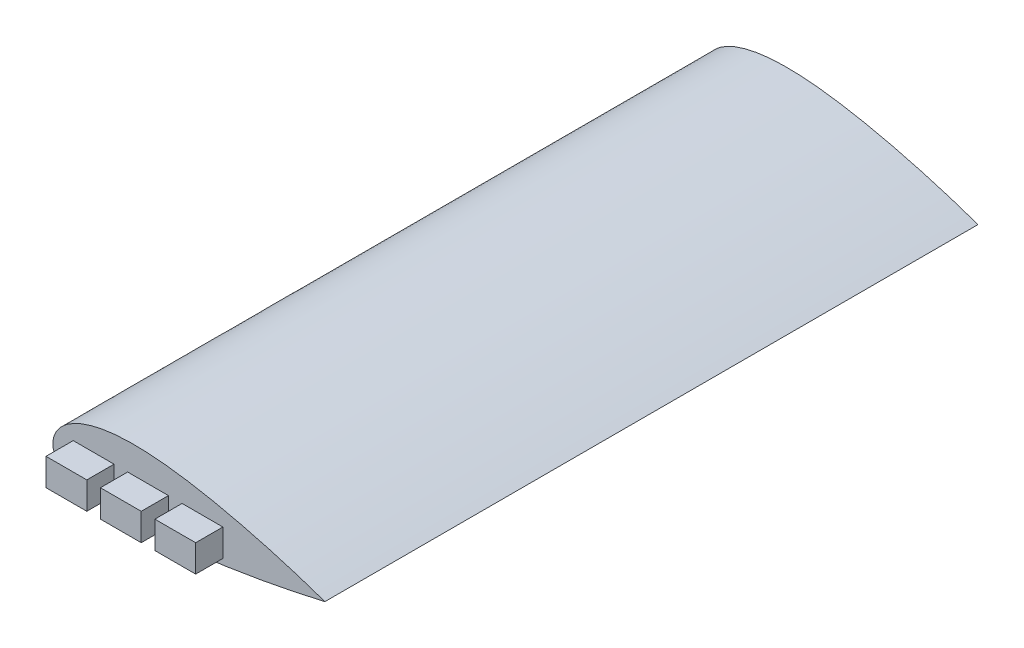
ISO-10303-21;
HEADER;
FILE_DESCRIPTION(('STEP AP214'),'2;1');
FILE_NAME('part.step','',(''),(''),'','','');
FILE_SCHEMA(('AUTOMOTIVE_DESIGN { 1 0 10303 214 1 1 1 1 }'));
ENDSEC;
DATA;
#1=APPLICATION_CONTEXT('core data for automotive mechanical design processes');
#2=APPLICATION_PROTOCOL_DEFINITION('international standard','automotive_design',2000,#1);
#3=PRODUCT_CONTEXT('',#1,'mechanical');
#4=PRODUCT('Part','Part','',(#3));
#5=PRODUCT_RELATED_PRODUCT_CATEGORY('part','',(#4));
#6=PRODUCT_DEFINITION_FORMATION('','',#4);
#7=PRODUCT_DEFINITION_CONTEXT('part definition',#1,'design');
#8=PRODUCT_DEFINITION('design','',#6,#7);
#9=PRODUCT_DEFINITION_SHAPE('','',#8);
#10=(LENGTH_UNIT() NAMED_UNIT(*) SI_UNIT(.MILLI.,.METRE.));
#11=(NAMED_UNIT(*) PLANE_ANGLE_UNIT() SI_UNIT($,.RADIAN.));
#12=(NAMED_UNIT(*) SI_UNIT($,.STERADIAN.) SOLID_ANGLE_UNIT());
#13=UNCERTAINTY_MEASURE_WITH_UNIT(LENGTH_MEASURE(1.E-05),#10,'distance_accuracy_value','');
#14=(GEOMETRIC_REPRESENTATION_CONTEXT(3) GLOBAL_UNCERTAINTY_ASSIGNED_CONTEXT((#13)) GLOBAL_UNIT_ASSIGNED_CONTEXT((#10,
#11,#12)) REPRESENTATION_CONTEXT('',''));
#15=CARTESIAN_POINT('',(0.,0.,0.));
#16=DIRECTION('',(0.,0.,1.));
#17=DIRECTION('',(1.,0.,0.));
#18=AXIS2_PLACEMENT_3D('',#15,#16,#17);
#19=CARTESIAN_POINT('',(0.,0.,125.));
#20=CARTESIAN_POINT('',(0.000283694063333354,-0.169267254453406,125.));
#21=CARTESIAN_POINT('',(0.0159767940668219,-0.461371136285982,125.));
#22=CARTESIAN_POINT('',(0.077487024771383,-0.88514163989418,125.));
#23=CARTESIAN_POINT('',(0.233270025784223,-1.43564988481677,125.));
#24=CARTESIAN_POINT('',(0.451244669499748,-1.96091850518129,125.));
#25=CARTESIAN_POINT('',(0.763020390680075,-2.51568290885771,125.));
#26=CARTESIAN_POINT('',(1.19681968312183,-3.11184641205846,125.));
#27=CARTESIAN_POINT('',(1.80094642938857,-3.76671123900316,125.));
#28=CARTESIAN_POINT('',(2.64586284499477,-4.49541317249192,125.));
#29=CARTESIAN_POINT('',(3.84500980685611,-5.31516311770543,125.));
#30=CARTESIAN_POINT('',(5.52019286873323,-6.21058744479242,125.));
#31=CARTESIAN_POINT('',(7.89048732661226,-7.18071487461165,125.));
#32=CARTESIAN_POINT('',(10.9470620487076,-8.09627648056987,125.));
#33=CARTESIAN_POINT('',(15.4296046071689,-9.03964097855671,125.));
#34=CARTESIAN_POINT('',(21.2079673661791,-9.73001113298884,125.));
#35=CARTESIAN_POINT('',(27.9775359918798,-10.0274621502473,125.));
#36=CARTESIAN_POINT('',(35.6486028756696,-9.88912829906542,125.));
#37=CARTESIAN_POINT('',(42.3468643354063,-9.46570665665719,125.));
#38=CARTESIAN_POINT('',(48.0748271030601,-8.93985542983438,125.));
#39=CARTESIAN_POINT('',(53.7914771788293,-8.30609592856954,125.));
#40=CARTESIAN_POINT('',(59.49683061861,-7.57655022215473,125.));
#41=CARTESIAN_POINT('',(65.1884999888793,-6.74605157792133,125.));
#42=CARTESIAN_POINT('',(70.8666683199729,-5.83024062202182,125.));
#43=CARTESIAN_POINT('',(75.5898698632803,-5.01418177414959,125.));
#44=CARTESIAN_POINT('',(79.3624472128974,-4.33071773017941,125.));
#45=CARTESIAN_POINT('',(82.659602016109,-3.70583024829414,125.));
#46=CARTESIAN_POINT('',(85.4801069964598,-3.15149152411546,125.));
#47=CARTESIAN_POINT('',(87.596226542746,-2.72328053338139,125.));
#48=CARTESIAN_POINT('',(89.0004891130609,-2.43412388465058,125.));
#49=CARTESIAN_POINT('',(90.1810594846734,-2.18718549633528,125.));
#50=CARTESIAN_POINT('',(91.1040292308201,-1.99256241658825,125.));
#51=CARTESIAN_POINT('',(92.3050998158475,-1.73539032834916,125.));
#52=CARTESIAN_POINT('',(93.6554040217478,-1.44386068745151,125.));
#53=CARTESIAN_POINT('',(95.3898106893253,-1.05964307714984,125.));
#54=CARTESIAN_POINT('',(97.1026637555893,-0.674849293285817,125.));
#55=CARTESIAN_POINT('',(98.7144505723077,-0.301843412019252,125.));
#56=CARTESIAN_POINT('',(99.5756271529091,-0.100232022205954,125.));
#57=CARTESIAN_POINT('',(100.000220499757,4.27538111521814E-10,125.));
#58=B_SPLINE_CURVE_WITH_KNOTS('',4,(#19,#20,#21,#22,#23,#24,#25,#26,#27,#28,#29,#30,#31,#32,#33,
#34,#35,#36,#37,#38,#39,#40,#41,#42,#43,#44,#45,#46,#47,#48,#49,#50,#51,#52,#53,#54,#55,#56,
#57),.UNSPECIFIED.,.F.,.F.,(5,1,1,1,1,1,1,1,1,1,1,1,1,1,1,1,1,1,1,1,1,1,1,1,1,1,1,1,1,1,1,1,1,1,
1,5),(0.,0.00588715154905901,0.0101933589214028,0.0148668514587516,0.0198894261791057,
0.0256553974171273,0.0323146974482692,0.0404975269047319,0.0508649023094947,0.064448178964699,
0.0828230857867248,0.10655566445833,0.139953894502326,0.175459216314004,0.242255955916231,
0.309052715876462,0.375849476599394,0.442646237076871,0.476044620001209,0.509443002925548,
0.57623976423232,0.643036526709283,0.676434909065151,0.709833291421019,0.743231670810562,
0.776630050200105,0.793329241625757,0.81002843305141,0.818378028764236,0.826727624477062,
0.835077220189888,0.843426815902715,0.86012600697153,0.876825198040345,0.893524389109161,
0.910223580157939),.UNSPECIFIED.);
#59=DIRECTION('',(0.,0.,-1.));
#60=VECTOR('',#59,1.);
#61=SURFACE_OF_LINEAR_EXTRUSION('',#58,#60);
#62=CARTESIAN_POINT('',(0.,0.,115.));
#63=CARTESIAN_POINT('',(0.000283694063333354,-0.169267254453406,115.));
#64=CARTESIAN_POINT('',(0.0159767940668219,-0.461371136285982,115.));
#65=CARTESIAN_POINT('',(0.077487024771383,-0.88514163989418,115.));
#66=CARTESIAN_POINT('',(0.233270025784223,-1.43564988481677,115.));
#67=CARTESIAN_POINT('',(0.451244669499748,-1.96091850518129,115.));
#68=CARTESIAN_POINT('',(0.763020390680075,-2.51568290885771,115.));
#69=CARTESIAN_POINT('',(1.19681968312183,-3.11184641205846,115.));
#70=CARTESIAN_POINT('',(1.80094642938857,-3.76671123900316,115.));
#71=CARTESIAN_POINT('',(2.64586284499477,-4.49541317249192,115.));
#72=CARTESIAN_POINT('',(3.84500980685611,-5.31516311770543,115.));
#73=CARTESIAN_POINT('',(5.52019286873323,-6.21058744479242,115.));
#74=CARTESIAN_POINT('',(7.89048732661226,-7.18071487461165,115.));
#75=CARTESIAN_POINT('',(10.9470620487076,-8.09627648056987,115.));
#76=CARTESIAN_POINT('',(15.4296046071689,-9.03964097855671,115.));
#77=CARTESIAN_POINT('',(21.2079673661791,-9.73001113298884,115.));
#78=CARTESIAN_POINT('',(27.9775359918798,-10.0274621502473,115.));
#79=CARTESIAN_POINT('',(35.6486028756696,-9.88912829906542,115.));
#80=CARTESIAN_POINT('',(42.3468643354063,-9.46570665665719,115.));
#81=CARTESIAN_POINT('',(48.0748271030601,-8.93985542983438,115.));
#82=CARTESIAN_POINT('',(53.7914771788293,-8.30609592856954,115.));
#83=CARTESIAN_POINT('',(59.49683061861,-7.57655022215473,115.));
#84=CARTESIAN_POINT('',(65.1884999888793,-6.74605157792133,115.));
#85=CARTESIAN_POINT('',(70.8666683199729,-5.83024062202182,115.));
#86=CARTESIAN_POINT('',(75.5898698632803,-5.01418177414959,115.));
#87=CARTESIAN_POINT('',(79.3624472128974,-4.33071773017941,115.));
#88=CARTESIAN_POINT('',(82.659602016109,-3.70583024829414,115.));
#89=CARTESIAN_POINT('',(85.4801069964598,-3.15149152411546,115.));
#90=CARTESIAN_POINT('',(87.596226542746,-2.72328053338139,115.));
#91=CARTESIAN_POINT('',(89.0004891130609,-2.43412388465058,115.));
#92=CARTESIAN_POINT('',(90.1810594846734,-2.18718549633528,115.));
#93=CARTESIAN_POINT('',(91.1040292308201,-1.99256241658825,115.));
#94=CARTESIAN_POINT('',(92.3050998158475,-1.73539032834916,115.));
#95=CARTESIAN_POINT('',(93.6554040217478,-1.44386068745151,115.));
#96=CARTESIAN_POINT('',(95.3898106893253,-1.05964307714984,115.));
#97=CARTESIAN_POINT('',(97.1026637555893,-0.674849293285817,115.));
#98=CARTESIAN_POINT('',(98.7144505723077,-0.301843412019252,115.));
#99=CARTESIAN_POINT('',(99.5756271529091,-0.100232022205954,115.));
#100=CARTESIAN_POINT('',(100.000220499757,4.27538111521814E-10,115.));
#101=B_SPLINE_CURVE_WITH_KNOTS('',4,(#62,#63,#64,#65,#66,#67,#68,#69,#70,#71,#72,#73,#74,#75,
#76,#77,#78,#79,#80,#81,#82,#83,#84,#85,#86,#87,#88,#89,#90,#91,#92,#93,#94,#95,#96,#97,#98,#99,
#100),.UNSPECIFIED.,.F.,.F.,(5,1,1,1,1,1,1,1,1,1,1,1,1,1,1,1,1,1,1,1,1,1,1,1,1,1,1,1,1,1,1,1,1,
1,1,5),(0.,0.00588715154905901,0.0101933589214028,0.0148668514587516,0.0198894261791057,
0.0256553974171273,0.0323146974482692,0.0404975269047319,0.0508649023094947,0.064448178964699,
0.0828230857867248,0.10655566445833,0.139953894502326,0.175459216314004,0.242255955916231,
0.309052715876462,0.375849476599394,0.442646237076871,0.476044620001209,0.509443002925548,
0.57623976423232,0.643036526709283,0.676434909065151,0.709833291421019,0.743231670810562,
0.776630050200105,0.793329241625757,0.81002843305141,0.818378028764236,0.826727624477062,
0.835077220189888,0.843426815902715,0.86012600697153,0.876825198040345,0.893524389109161,
0.910223580157939),.UNSPECIFIED.);
#102=CARTESIAN_POINT('',(0.,0.,115.));
#103=VERTEX_POINT('',#102);
#104=CARTESIAN_POINT('',(100.000220497727,7.74826209021324E-11,115.));
#105=VERTEX_POINT('',#104);
#106=EDGE_CURVE('E52',#103,#105,#101,.T.);
#107=ORIENTED_EDGE('',*,*,#106,.F.);
#108=DIRECTION('',(0.,0.,-1.));
#109=VECTOR('',#108,1.);
#110=CARTESIAN_POINT('',(0.,0.,125.));
#111=LINE('',#110,#109);
#112=CARTESIAN_POINT('',(0.,0.,-125.));
#113=VERTEX_POINT('',#112);
#114=EDGE_CURVE('E341',#103,#113,#111,.T.);
#115=ORIENTED_EDGE('',*,*,#114,.T.);
#116=CARTESIAN_POINT('',(0.,0.,-125.));
#117=CARTESIAN_POINT('',(0.000283694063333354,-0.169267254453406,-125.));
#118=CARTESIAN_POINT('',(0.0159767940668219,-0.461371136285982,-125.));
#119=CARTESIAN_POINT('',(0.077487024771383,-0.88514163989418,-125.));
#120=CARTESIAN_POINT('',(0.233270025784223,-1.43564988481677,-125.));
#121=CARTESIAN_POINT('',(0.451244669499748,-1.96091850518129,-125.));
#122=CARTESIAN_POINT('',(0.763020390680075,-2.51568290885771,-125.));
#123=CARTESIAN_POINT('',(1.19681968312183,-3.11184641205846,-125.));
#124=CARTESIAN_POINT('',(1.80094642938857,-3.76671123900316,-125.));
#125=CARTESIAN_POINT('',(2.64586284499477,-4.49541317249192,-125.));
#126=CARTESIAN_POINT('',(3.84500980685611,-5.31516311770543,-125.));
#127=CARTESIAN_POINT('',(5.52019286873323,-6.21058744479242,-125.));
#128=CARTESIAN_POINT('',(7.89048732661226,-7.18071487461165,-125.));
#129=CARTESIAN_POINT('',(10.9470620487076,-8.09627648056987,-125.));
#130=CARTESIAN_POINT('',(15.4296046071689,-9.03964097855671,-125.));
#131=CARTESIAN_POINT('',(21.2079673661791,-9.73001113298884,-125.));
#132=CARTESIAN_POINT('',(27.9775359918798,-10.0274621502473,-125.));
#133=CARTESIAN_POINT('',(35.6486028756696,-9.88912829906542,-125.));
#134=CARTESIAN_POINT('',(42.3468643354063,-9.46570665665719,-125.));
#135=CARTESIAN_POINT('',(48.0748271030601,-8.93985542983438,-125.));
#136=CARTESIAN_POINT('',(53.7914771788293,-8.30609592856954,-125.));
#137=CARTESIAN_POINT('',(59.49683061861,-7.57655022215473,-125.));
#138=CARTESIAN_POINT('',(65.1884999888793,-6.74605157792133,-125.));
#139=CARTESIAN_POINT('',(70.8666683199729,-5.83024062202182,-125.));
#140=CARTESIAN_POINT('',(75.5898698632803,-5.01418177414959,-125.));
#141=CARTESIAN_POINT('',(79.3624472128974,-4.33071773017941,-125.));
#142=CARTESIAN_POINT('',(82.659602016109,-3.70583024829414,-125.));
#143=CARTESIAN_POINT('',(85.4801069964598,-3.15149152411546,-125.));
#144=CARTESIAN_POINT('',(87.596226542746,-2.72328053338139,-125.));
#145=CARTESIAN_POINT('',(89.0004891130609,-2.43412388465058,-125.));
#146=CARTESIAN_POINT('',(90.1810594846734,-2.18718549633528,-125.));
#147=CARTESIAN_POINT('',(91.1040292308201,-1.99256241658825,-125.));
#148=CARTESIAN_POINT('',(92.3050998158475,-1.73539032834916,-125.));
#149=CARTESIAN_POINT('',(93.6554040217478,-1.44386068745151,-125.));
#150=CARTESIAN_POINT('',(95.3898106893253,-1.05964307714984,-125.));
#151=CARTESIAN_POINT('',(97.1026637555893,-0.674849293285817,-125.));
#152=CARTESIAN_POINT('',(98.7144505723077,-0.301843412019252,-125.));
#153=CARTESIAN_POINT('',(99.5756271529091,-0.100232022205954,-125.));
#154=CARTESIAN_POINT('',(100.000220499757,4.27538111521814E-10,-125.));
#155=B_SPLINE_CURVE_WITH_KNOTS('',4,(#116,#117,#118,#119,#120,#121,#122,#123,#124,#125,#126,
#127,#128,#129,#130,#131,#132,#133,#134,#135,#136,#137,#138,#139,#140,#141,#142,#143,#144,#145,
#146,#147,#148,#149,#150,#151,#152,#153,#154),.UNSPECIFIED.,.F.,.F.,(5,1,1,1,1,1,1,1,1,1,1,1,1,
1,1,1,1,1,1,1,1,1,1,1,1,1,1,1,1,1,1,1,1,1,1,5),(0.,0.00588715154905901,0.0101933589214028,
0.0148668514587516,0.0198894261791057,0.0256553974171273,0.0323146974482692,0.0404975269047319,
0.0508649023094947,0.064448178964699,0.0828230857867248,0.10655566445833,0.139953894502326,
0.175459216314004,0.242255955916231,0.309052715876462,0.375849476599394,0.442646237076871,
0.476044620001209,0.509443002925548,0.57623976423232,0.643036526709283,0.676434909065151,
0.709833291421019,0.743231670810562,0.776630050200105,0.793329241625757,0.81002843305141,
0.818378028764236,0.826727624477062,0.835077220189888,0.843426815902715,0.86012600697153,
0.876825198040345,0.893524389109161,0.910223580157939),.UNSPECIFIED.);
#156=CARTESIAN_POINT('',(100.000220497727,7.74826209021324E-11,-125.));
#157=VERTEX_POINT('',#156);
#158=EDGE_CURVE('E324',#113,#157,#155,.T.);
#159=ORIENTED_EDGE('',*,*,#158,.T.);
#160=DIRECTION('',(0.,0.,-1.));
#161=VECTOR('',#160,1.);
#162=CARTESIAN_POINT('',(100.000220497727,7.74826209021324E-11,125.));
#163=LINE('',#162,#161);
#164=EDGE_CURVE('E47',#105,#157,#163,.T.);
#165=ORIENTED_EDGE('',*,*,#164,.F.);
#166=EDGE_LOOP('',(#107,#115,#159,#165));
#167=FACE_BOUND('',#166,.T.);
#168=ADVANCED_FACE('F37',(#167),#61,.F.);
#169=CARTESIAN_POINT('',(100.000220497727,7.74826209021324E-11,125.));
#170=CARTESIAN_POINT('',(99.5866642694272,0.146529650141644,125.));
#171=CARTESIAN_POINT('',(98.775140124959,0.431667146722528,125.));
#172=CARTESIAN_POINT('',(97.1383013596421,1.0009448593004,125.));
#173=CARTESIAN_POINT('',(95.5201536219595,1.54629412604241,125.));
#174=CARTESIAN_POINT('',(93.5710424127269,2.19555173767905,125.));
#175=CARTESIAN_POINT('',(91.8060339087632,2.76657559109394,125.));
#176=CARTESIAN_POINT('',(89.9289485013176,3.36462288486606,125.));
#177=CARTESIAN_POINT('',(88.1107461076308,3.92939510407735,125.));
#178=CARTESIAN_POINT('',(86.2537376155131,4.49573782099316,125.));
#179=CARTESIAN_POINT('',(84.4127461033344,5.04441519253935,125.));
#180=CARTESIAN_POINT('',(82.0959555474998,5.72096027189785,125.));
#181=CARTESIAN_POINT('',(79.3157485343101,6.50932427591325,125.));
#182=CARTESIAN_POINT('',(76.0598011549019,7.39936223716674,125.));
#183=CARTESIAN_POINT('',(72.3294262722737,8.37255611177963,125.));
#184=CARTESIAN_POINT('',(68.5864601940137,9.3014640978493,125.));
#185=CARTESIAN_POINT('',(64.832774322819,10.1829703393817,125.));
#186=CARTESIAN_POINT('',(61.0671483874732,11.0139213357228,125.));
#187=CARTESIAN_POINT('',(56.3455787547304,11.9833516977112,125.));
#188=CARTESIAN_POINT('',(51.6037180711226,12.8505137555291,125.));
#189=CARTESIAN_POINT('',(46.841005730155,13.5967745663557,125.));
#190=CARTESIAN_POINT('',(41.1010612259678,14.3137531123523,125.));
#191=CARTESIAN_POINT('',(35.3379801907108,14.8247996680982,125.));
#192=CARTESIAN_POINT('',(29.2356829585059,15.0274458231264,125.));
#193=CARTESIAN_POINT('',(23.1343223198202,14.7365696045775,125.));
#194=CARTESIAN_POINT('',(18.0404606093291,14.0363288531348,125.));
#195=CARTESIAN_POINT('',(14.1476534921483,13.1525343183008,125.));
#196=CARTESIAN_POINT('',(10.9569632810599,12.1146314327558,125.));
#197=CARTESIAN_POINT('',(8.27408643464805,10.9291862288056,125.));
#198=CARTESIAN_POINT('',(6.15403284092467,9.71494891854934,125.));
#199=CARTESIAN_POINT('',(4.49593380655627,8.51062575858427,125.));
#200=CARTESIAN_POINT('',(3.20033079537978,7.32999492228908,125.));
#201=CARTESIAN_POINT('',(2.19231516242372,6.17730577602011,125.));
#202=CARTESIAN_POINT('',(1.43145787309525,5.07560620825464,125.));
#203=CARTESIAN_POINT('',(0.854897816381184,3.99067399021966,125.));
#204=CARTESIAN_POINT('',(0.437026819139792,2.91811654456705,125.));
#205=CARTESIAN_POINT('',(0.143851329684659,1.7967459021599,125.));
#206=CARTESIAN_POINT('',(0.0295498653493342,0.927472015318214,125.));
#207=CARTESIAN_POINT('',(0.000850995267059923,0.329659199222127,125.));
#208=CARTESIAN_POINT('',(0.,0.,125.));
#209=B_SPLINE_CURVE_WITH_KNOTS('',4,(#169,#170,#171,#172,#173,#174,#175,#176,#177,#178,#179,
#180,#181,#182,#183,#184,#185,#186,#187,#188,#189,#190,#191,#192,#193,#194,#195,#196,#197,#198,
#199,#200,#201,#202,#203,#204,#205,#206,#207,#208),.UNSPECIFIED.,.F.,.F.,(5,1,1,1,1,1,1,1,1,1,1,
1,1,1,1,1,1,1,1,1,1,1,1,1,1,1,1,1,1,1,1,1,1,1,1,1,5),(0.,0.0161684388922648,0.0323395717476721,
0.0485107046030794,0.0646818374584867,0.0808529669347967,0.0970240964111069,0.113195225887417,
0.129366355363727,0.145537483468899,0.161708611574071,0.194050867784415,0.226393127402294,
0.258735387020172,0.291077649856262,0.323419912692352,0.355762172547114,0.388104432401876,
0.452788946311646,0.485131206531116,0.517473466750585,0.582157982254849,0.646842489324408,
0.689784621390112,0.722126932647819,0.754469038652625,0.780606905242231,0.802168575944157,
0.82036335835708,0.836287728406092,0.849224342016667,0.86085384754246,0.87163201202684,
0.881108097545938,0.890352169571197,0.899387833639312,0.910433902416971),.UNSPECIFIED.);
#210=DIRECTION('',(0.,0.,-1.));
#211=VECTOR('',#210,1.);
#212=SURFACE_OF_LINEAR_EXTRUSION('',#209,#211);
#213=CARTESIAN_POINT('',(100.000220497727,7.74826209021324E-11,115.));
#214=CARTESIAN_POINT('',(99.5866642694272,0.146529650141644,115.));
#215=CARTESIAN_POINT('',(98.775140124959,0.431667146722528,115.));
#216=CARTESIAN_POINT('',(97.1383013596421,1.0009448593004,115.));
#217=CARTESIAN_POINT('',(95.5201536219595,1.54629412604241,115.));
#218=CARTESIAN_POINT('',(93.5710424127269,2.19555173767905,115.));
#219=CARTESIAN_POINT('',(91.8060339087632,2.76657559109394,115.));
#220=CARTESIAN_POINT('',(89.9289485013176,3.36462288486606,115.));
#221=CARTESIAN_POINT('',(88.1107461076308,3.92939510407735,115.));
#222=CARTESIAN_POINT('',(86.2537376155131,4.49573782099316,115.));
#223=CARTESIAN_POINT('',(84.4127461033344,5.04441519253935,115.));
#224=CARTESIAN_POINT('',(82.0959555474998,5.72096027189785,115.));
#225=CARTESIAN_POINT('',(79.3157485343101,6.50932427591325,115.));
#226=CARTESIAN_POINT('',(76.0598011549019,7.39936223716674,115.));
#227=CARTESIAN_POINT('',(72.3294262722737,8.37255611177963,115.));
#228=CARTESIAN_POINT('',(68.5864601940137,9.3014640978493,115.));
#229=CARTESIAN_POINT('',(64.832774322819,10.1829703393817,115.));
#230=CARTESIAN_POINT('',(61.0671483874732,11.0139213357228,115.));
#231=CARTESIAN_POINT('',(56.3455787547304,11.9833516977112,115.));
#232=CARTESIAN_POINT('',(51.6037180711226,12.8505137555291,115.));
#233=CARTESIAN_POINT('',(46.841005730155,13.5967745663557,115.));
#234=CARTESIAN_POINT('',(41.1010612259678,14.3137531123523,115.));
#235=CARTESIAN_POINT('',(35.3379801907108,14.8247996680982,115.));
#236=CARTESIAN_POINT('',(29.2356829585059,15.0274458231264,115.));
#237=CARTESIAN_POINT('',(23.1343223198202,14.7365696045775,115.));
#238=CARTESIAN_POINT('',(18.0404606093291,14.0363288531348,115.));
#239=CARTESIAN_POINT('',(14.1476534921483,13.1525343183008,115.));
#240=CARTESIAN_POINT('',(10.9569632810599,12.1146314327558,115.));
#241=CARTESIAN_POINT('',(8.27408643464805,10.9291862288056,115.));
#242=CARTESIAN_POINT('',(6.15403284092467,9.71494891854934,115.));
#243=CARTESIAN_POINT('',(4.49593380655627,8.51062575858427,115.));
#244=CARTESIAN_POINT('',(3.20033079537978,7.32999492228908,115.));
#245=CARTESIAN_POINT('',(2.19231516242372,6.17730577602011,115.));
#246=CARTESIAN_POINT('',(1.43145787309525,5.07560620825464,115.));
#247=CARTESIAN_POINT('',(0.854897816381184,3.99067399021966,115.));
#248=CARTESIAN_POINT('',(0.437026819139792,2.91811654456705,115.));
#249=CARTESIAN_POINT('',(0.143851329684659,1.7967459021599,115.));
#250=CARTESIAN_POINT('',(0.0295498653493342,0.927472015318214,115.));
#251=CARTESIAN_POINT('',(0.000850995267059923,0.329659199222127,115.));
#252=CARTESIAN_POINT('',(0.,0.,115.));
#253=B_SPLINE_CURVE_WITH_KNOTS('',4,(#213,#214,#215,#216,#217,#218,#219,#220,#221,#222,#223,
#224,#225,#226,#227,#228,#229,#230,#231,#232,#233,#234,#235,#236,#237,#238,#239,#240,#241,#242,
#243,#244,#245,#246,#247,#248,#249,#250,#251,#252),.UNSPECIFIED.,.F.,.F.,(5,1,1,1,1,1,1,1,1,1,1,
1,1,1,1,1,1,1,1,1,1,1,1,1,1,1,1,1,1,1,1,1,1,1,1,1,5),(0.,0.0161684388922648,0.0323395717476721,
0.0485107046030794,0.0646818374584867,0.0808529669347967,0.0970240964111069,0.113195225887417,
0.129366355363727,0.145537483468899,0.161708611574071,0.194050867784415,0.226393127402294,
0.258735387020172,0.291077649856262,0.323419912692352,0.355762172547114,0.388104432401876,
0.452788946311646,0.485131206531116,0.517473466750585,0.582157982254849,0.646842489324408,
0.689784621390112,0.722126932647819,0.754469038652625,0.780606905242231,0.802168575944157,
0.82036335835708,0.836287728406092,0.849224342016667,0.86085384754246,0.87163201202684,
0.881108097545938,0.890352169571197,0.899387833639312,0.910433902416971),.UNSPECIFIED.);
#254=EDGE_CURVE('E12',#105,#103,#253,.T.);
#255=ORIENTED_EDGE('',*,*,#254,.F.);
#256=ORIENTED_EDGE('',*,*,#164,.T.);
#257=CARTESIAN_POINT('',(100.000220497727,7.74826209021324E-11,-125.));
#258=CARTESIAN_POINT('',(99.5866642694272,0.146529650141644,-125.));
#259=CARTESIAN_POINT('',(98.775140124959,0.431667146722528,-125.));
#260=CARTESIAN_POINT('',(97.1383013596421,1.0009448593004,-125.));
#261=CARTESIAN_POINT('',(95.5201536219595,1.54629412604241,-125.));
#262=CARTESIAN_POINT('',(93.5710424127269,2.19555173767905,-125.));
#263=CARTESIAN_POINT('',(91.8060339087632,2.76657559109394,-125.));
#264=CARTESIAN_POINT('',(89.9289485013176,3.36462288486606,-125.));
#265=CARTESIAN_POINT('',(88.1107461076308,3.92939510407735,-125.));
#266=CARTESIAN_POINT('',(86.2537376155131,4.49573782099316,-125.));
#267=CARTESIAN_POINT('',(84.4127461033344,5.04441519253935,-125.));
#268=CARTESIAN_POINT('',(82.0959555474998,5.72096027189785,-125.));
#269=CARTESIAN_POINT('',(79.3157485343101,6.50932427591325,-125.));
#270=CARTESIAN_POINT('',(76.0598011549019,7.39936223716674,-125.));
#271=CARTESIAN_POINT('',(72.3294262722737,8.37255611177963,-125.));
#272=CARTESIAN_POINT('',(68.5864601940137,9.3014640978493,-125.));
#273=CARTESIAN_POINT('',(64.832774322819,10.1829703393817,-125.));
#274=CARTESIAN_POINT('',(61.0671483874732,11.0139213357228,-125.));
#275=CARTESIAN_POINT('',(56.3455787547304,11.9833516977112,-125.));
#276=CARTESIAN_POINT('',(51.6037180711226,12.8505137555291,-125.));
#277=CARTESIAN_POINT('',(46.841005730155,13.5967745663557,-125.));
#278=CARTESIAN_POINT('',(41.1010612259678,14.3137531123523,-125.));
#279=CARTESIAN_POINT('',(35.3379801907108,14.8247996680982,-125.));
#280=CARTESIAN_POINT('',(29.2356829585059,15.0274458231264,-125.));
#281=CARTESIAN_POINT('',(23.1343223198202,14.7365696045775,-125.));
#282=CARTESIAN_POINT('',(18.0404606093291,14.0363288531348,-125.));
#283=CARTESIAN_POINT('',(14.1476534921483,13.1525343183008,-125.));
#284=CARTESIAN_POINT('',(10.9569632810599,12.1146314327558,-125.));
#285=CARTESIAN_POINT('',(8.27408643464805,10.9291862288056,-125.));
#286=CARTESIAN_POINT('',(6.15403284092467,9.71494891854934,-125.));
#287=CARTESIAN_POINT('',(4.49593380655627,8.51062575858427,-125.));
#288=CARTESIAN_POINT('',(3.20033079537978,7.32999492228908,-125.));
#289=CARTESIAN_POINT('',(2.19231516242372,6.17730577602011,-125.));
#290=CARTESIAN_POINT('',(1.43145787309525,5.07560620825464,-125.));
#291=CARTESIAN_POINT('',(0.854897816381184,3.99067399021966,-125.));
#292=CARTESIAN_POINT('',(0.437026819139792,2.91811654456705,-125.));
#293=CARTESIAN_POINT('',(0.143851329684659,1.7967459021599,-125.));
#294=CARTESIAN_POINT('',(0.0295498653493342,0.927472015318214,-125.));
#295=CARTESIAN_POINT('',(0.000850995267059923,0.329659199222127,-125.));
#296=CARTESIAN_POINT('',(0.,0.,-125.));
#297=B_SPLINE_CURVE_WITH_KNOTS('',4,(#257,#258,#259,#260,#261,#262,#263,#264,#265,#266,#267,
#268,#269,#270,#271,#272,#273,#274,#275,#276,#277,#278,#279,#280,#281,#282,#283,#284,#285,#286,
#287,#288,#289,#290,#291,#292,#293,#294,#295,#296),.UNSPECIFIED.,.F.,.F.,(5,1,1,1,1,1,1,1,1,1,1,
1,1,1,1,1,1,1,1,1,1,1,1,1,1,1,1,1,1,1,1,1,1,1,1,1,5),(0.,0.0161684388922648,0.0323395717476721,
0.0485107046030794,0.0646818374584867,0.0808529669347967,0.0970240964111069,0.113195225887417,
0.129366355363727,0.145537483468899,0.161708611574071,0.194050867784415,0.226393127402294,
0.258735387020172,0.291077649856262,0.323419912692352,0.355762172547114,0.388104432401876,
0.452788946311646,0.485131206531116,0.517473466750585,0.582157982254849,0.646842489324408,
0.689784621390112,0.722126932647819,0.754469038652625,0.780606905242231,0.802168575944157,
0.82036335835708,0.836287728406092,0.849224342016667,0.86085384754246,0.87163201202684,
0.881108097545938,0.890352169571197,0.899387833639312,0.910433902416971),.UNSPECIFIED.);
#298=EDGE_CURVE('E332',#157,#113,#297,.T.);
#299=ORIENTED_EDGE('',*,*,#298,.T.);
#300=ORIENTED_EDGE('',*,*,#114,.F.);
#301=EDGE_LOOP('',(#255,#256,#299,#300));
#302=FACE_BOUND('',#301,.T.);
#303=ADVANCED_FACE('F311',(#302),#212,.F.);
#304=CARTESIAN_POINT('',(48.5429190731923,-8.87264976056938,-125.));
#305=DIRECTION('',(0.,0.,-1.));
#306=DIRECTION('',(-1.,0.,0.));
#307=AXIS2_PLACEMENT_3D('',#304,#305,#306);
#308=PLANE('',#307);
#309=ORIENTED_EDGE('',*,*,#158,.F.);
#310=ORIENTED_EDGE('',*,*,#298,.F.);
#311=EDGE_LOOP('',(#309,#310));
#312=FACE_BOUND('',#311,.T.);
#313=ADVANCED_FACE('F309',(#312),#308,.T.);
#314=CARTESIAN_POINT('',(50.0001102498784,2.49999183643953,115.));
#315=DIRECTION('',(0.,0.,1.));
#316=DIRECTION('',(1.,0.,0.));
#317=AXIS2_PLACEMENT_3D('',#314,#315,#316);
#318=PLANE('',#317);
#319=DIRECTION('',(-1.,0.,0.));
#320=VECTOR('',#319,1.);
#321=CARTESIAN_POINT('',(27.5,5.,115.));
#322=LINE('',#321,#320);
#323=CARTESIAN_POINT('',(42.5,5.,115.));
#324=VERTEX_POINT('',#323);
#325=CARTESIAN_POINT('',(27.5,5.,115.));
#326=VERTEX_POINT('',#325);
#327=EDGE_CURVE('E239',#324,#326,#322,.T.);
#328=ORIENTED_EDGE('',*,*,#327,.F.);
#329=DIRECTION('',(0.,1.,0.));
#330=VECTOR('',#329,1.);
#331=CARTESIAN_POINT('',(42.5,-5.,115.));
#332=LINE('',#331,#330);
#333=CARTESIAN_POINT('',(42.5,-5.,115.));
#334=VERTEX_POINT('',#333);
#335=EDGE_CURVE('E236',#334,#324,#332,.T.);
#336=ORIENTED_EDGE('',*,*,#335,.F.);
#337=DIRECTION('',(1.,0.,0.));
#338=VECTOR('',#337,1.);
#339=CARTESIAN_POINT('',(27.5,-5.,115.));
#340=LINE('',#339,#338);
#341=CARTESIAN_POINT('',(27.5,-5.,115.));
#342=VERTEX_POINT('',#341);
#343=EDGE_CURVE('E232',#342,#334,#340,.T.);
#344=ORIENTED_EDGE('',*,*,#343,.F.);
#345=DIRECTION('',(0.,-1.,0.));
#346=VECTOR('',#345,1.);
#347=CARTESIAN_POINT('',(27.5,-5.,115.));
#348=LINE('',#347,#346);
#349=EDGE_CURVE('E229',#326,#342,#348,.T.);
#350=ORIENTED_EDGE('',*,*,#349,.F.);
#351=EDGE_LOOP('',(#328,#336,#344,#350));
#352=FACE_BOUND('',#351,.T.);
#353=DIRECTION('',(1.,0.,0.));
#354=VECTOR('',#353,1.);
#355=CARTESIAN_POINT('',(22.5,-5.,115.));
#356=LINE('',#355,#354);
#357=CARTESIAN_POINT('',(7.50000000000001,-5.,115.));
#358=VERTEX_POINT('',#357);
#359=CARTESIAN_POINT('',(22.5,-5.,115.));
#360=VERTEX_POINT('',#359);
#361=EDGE_CURVE('E206',#358,#360,#356,.T.);
#362=ORIENTED_EDGE('',*,*,#361,.F.);
#363=DIRECTION('',(0.,-1.,0.));
#364=VECTOR('',#363,1.);
#365=CARTESIAN_POINT('',(7.50000000000001,5.,115.));
#366=LINE('',#365,#364);
#367=CARTESIAN_POINT('',(7.50000000000001,5.,115.));
#368=VERTEX_POINT('',#367);
#369=EDGE_CURVE('E203',#368,#358,#366,.T.);
#370=ORIENTED_EDGE('',*,*,#369,.F.);
#371=DIRECTION('',(-1.,0.,0.));
#372=VECTOR('',#371,1.);
#373=CARTESIAN_POINT('',(22.5,5.,115.));
#374=LINE('',#373,#372);
#375=CARTESIAN_POINT('',(22.5,5.,115.));
#376=VERTEX_POINT('',#375);
#377=EDGE_CURVE('E199',#376,#368,#374,.T.);
#378=ORIENTED_EDGE('',*,*,#377,.F.);
#379=DIRECTION('',(0.,1.,0.));
#380=VECTOR('',#379,1.);
#381=CARTESIAN_POINT('',(22.5,5.,115.));
#382=LINE('',#381,#380);
#383=EDGE_CURVE('E196',#360,#376,#382,.T.);
#384=ORIENTED_EDGE('',*,*,#383,.F.);
#385=EDGE_LOOP('',(#362,#370,#378,#384));
#386=FACE_BOUND('',#385,.T.);
#387=DIRECTION('',(-1.,0.,0.));
#388=VECTOR('',#387,1.);
#389=CARTESIAN_POINT('',(47.5,5.,115.));
#390=LINE('',#389,#388);
#391=CARTESIAN_POINT('',(62.5,5.,115.));
#392=VERTEX_POINT('',#391);
#393=CARTESIAN_POINT('',(47.5,5.,115.));
#394=VERTEX_POINT('',#393);
#395=EDGE_CURVE('E164',#392,#394,#390,.T.);
#396=ORIENTED_EDGE('',*,*,#395,.F.);
#397=DIRECTION('',(0.,1.,0.));
#398=VECTOR('',#397,1.);
#399=CARTESIAN_POINT('',(62.5,5.,115.));
#400=LINE('',#399,#398);
#401=CARTESIAN_POINT('',(62.5,-5.,115.));
#402=VERTEX_POINT('',#401);
#403=EDGE_CURVE('E173',#402,#392,#400,.T.);
#404=ORIENTED_EDGE('',*,*,#403,.F.);
#405=DIRECTION('',(1.,0.,0.));
#406=VECTOR('',#405,1.);
#407=CARTESIAN_POINT('',(47.5,-4.99999999999999,115.));
#408=LINE('',#407,#406);
#409=CARTESIAN_POINT('',(47.5,-4.99999999999999,115.));
#410=VERTEX_POINT('',#409);
#411=EDGE_CURVE('E156',#410,#402,#408,.T.);
#412=ORIENTED_EDGE('',*,*,#411,.F.);
#413=DIRECTION('',(0.,-1.,0.));
#414=VECTOR('',#413,1.);
#415=CARTESIAN_POINT('',(47.5,5.,115.));
#416=LINE('',#415,#414);
#417=EDGE_CURVE('E170',#394,#410,#416,.T.);
#418=ORIENTED_EDGE('',*,*,#417,.F.);
#419=EDGE_LOOP('',(#396,#404,#412,#418));
#420=FACE_BOUND('',#419,.T.);
#421=ORIENTED_EDGE('',*,*,#106,.T.);
#422=ORIENTED_EDGE('',*,*,#254,.T.);
#423=EDGE_LOOP('',(#421,#422));
#424=FACE_BOUND('',#423,.T.);
#425=ADVANCED_FACE('F169',(#352,#386,#420,#424),#318,.T.);
#426=CARTESIAN_POINT('',(27.5,-5.,115.));
#427=DIRECTION('',(-1.,0.,0.));
#428=DIRECTION('',(0.,0.,1.));
#429=AXIS2_PLACEMENT_3D('',#426,#427,#428);
#430=PLANE('',#429);
#431=DIRECTION('',(0.,-1.,0.));
#432=VECTOR('',#431,1.);
#433=CARTESIAN_POINT('',(27.5,-5.,125.));
#434=LINE('',#433,#432);
#435=CARTESIAN_POINT('',(27.5,5.,125.));
#436=VERTEX_POINT('',#435);
#437=CARTESIAN_POINT('',(27.5,-5.,125.));
#438=VERTEX_POINT('',#437);
#439=EDGE_CURVE('E222',#436,#438,#434,.T.);
#440=ORIENTED_EDGE('',*,*,#439,.F.);
#441=DIRECTION('',(0.,0.,1.));
#442=VECTOR('',#441,1.);
#443=CARTESIAN_POINT('',(27.5,5.,115.));
#444=LINE('',#443,#442);
#445=EDGE_CURVE('E251',#326,#436,#444,.T.);
#446=ORIENTED_EDGE('',*,*,#445,.F.);
#447=ORIENTED_EDGE('',*,*,#349,.T.);
#448=DIRECTION('',(0.,0.,1.));
#449=VECTOR('',#448,1.);
#450=CARTESIAN_POINT('',(27.5,-5.,115.));
#451=LINE('',#450,#449);
#452=EDGE_CURVE('E242',#342,#438,#451,.T.);
#453=ORIENTED_EDGE('',*,*,#452,.T.);
#454=EDGE_LOOP('',(#440,#446,#447,#453));
#455=FACE_BOUND('',#454,.T.);
#456=ADVANCED_FACE('F369',(#455),#430,.T.);
#457=CARTESIAN_POINT('',(27.5,5.,115.));
#458=DIRECTION('',(0.,1.,0.));
#459=DIRECTION('',(0.,0.,1.));
#460=AXIS2_PLACEMENT_3D('',#457,#458,#459);
#461=PLANE('',#460);
#462=DIRECTION('',(-1.,0.,0.));
#463=VECTOR('',#462,1.);
#464=CARTESIAN_POINT('',(27.5,5.,125.));
#465=LINE('',#464,#463);
#466=CARTESIAN_POINT('',(42.5,5.,125.));
#467=VERTEX_POINT('',#466);
#468=EDGE_CURVE('E233',#467,#436,#465,.T.);
#469=ORIENTED_EDGE('',*,*,#468,.F.);
#470=DIRECTION('',(0.,0.,1.));
#471=VECTOR('',#470,1.);
#472=CARTESIAN_POINT('',(42.5,5.,115.));
#473=LINE('',#472,#471);
#474=EDGE_CURVE('E253',#324,#467,#473,.T.);
#475=ORIENTED_EDGE('',*,*,#474,.F.);
#476=ORIENTED_EDGE('',*,*,#327,.T.);
#477=ORIENTED_EDGE('',*,*,#445,.T.);
#478=EDGE_LOOP('',(#469,#475,#476,#477));
#479=FACE_BOUND('',#478,.T.);
#480=ADVANCED_FACE('F377',(#479),#461,.T.);
#481=CARTESIAN_POINT('',(42.5,-5.,115.));
#482=DIRECTION('',(1.,0.,0.));
#483=DIRECTION('',(0.,0.,-1.));
#484=AXIS2_PLACEMENT_3D('',#481,#482,#483);
#485=PLANE('',#484);
#486=DIRECTION('',(0.,1.,0.));
#487=VECTOR('',#486,1.);
#488=CARTESIAN_POINT('',(42.5,-5.,125.));
#489=LINE('',#488,#487);
#490=CARTESIAN_POINT('',(42.5,-5.,125.));
#491=VERTEX_POINT('',#490);
#492=EDGE_CURVE('E60',#491,#467,#489,.T.);
#493=ORIENTED_EDGE('',*,*,#492,.F.);
#494=DIRECTION('',(0.,0.,1.));
#495=VECTOR('',#494,1.);
#496=CARTESIAN_POINT('',(42.5,-5.,115.));
#497=LINE('',#496,#495);
#498=EDGE_CURVE('E255',#334,#491,#497,.T.);
#499=ORIENTED_EDGE('',*,*,#498,.F.);
#500=ORIENTED_EDGE('',*,*,#335,.T.);
#501=ORIENTED_EDGE('',*,*,#474,.T.);
#502=EDGE_LOOP('',(#493,#499,#500,#501));
#503=FACE_BOUND('',#502,.T.);
#504=ADVANCED_FACE('F385',(#503),#485,.T.);
#505=CARTESIAN_POINT('',(27.5,-5.,115.));
#506=DIRECTION('',(0.,-1.,0.));
#507=DIRECTION('',(0.,0.,-1.));
#508=AXIS2_PLACEMENT_3D('',#505,#506,#507);
#509=PLANE('',#508);
#510=DIRECTION('',(1.,0.,0.));
#511=VECTOR('',#510,1.);
#512=CARTESIAN_POINT('',(27.5,-5.,125.));
#513=LINE('',#512,#511);
#514=EDGE_CURVE('E245',#438,#491,#513,.T.);
#515=ORIENTED_EDGE('',*,*,#514,.F.);
#516=ORIENTED_EDGE('',*,*,#452,.F.);
#517=ORIENTED_EDGE('',*,*,#343,.T.);
#518=ORIENTED_EDGE('',*,*,#498,.T.);
#519=EDGE_LOOP('',(#515,#516,#517,#518));
#520=FACE_BOUND('',#519,.T.);
#521=ADVANCED_FACE('F393',(#520),#509,.T.);
#522=CARTESIAN_POINT('',(22.5,5.,115.));
#523=DIRECTION('',(1.,0.,0.));
#524=DIRECTION('',(0.,0.,-1.));
#525=AXIS2_PLACEMENT_3D('',#522,#523,#524);
#526=PLANE('',#525);
#527=DIRECTION('',(0.,1.,0.));
#528=VECTOR('',#527,1.);
#529=CARTESIAN_POINT('',(22.5,5.,125.));
#530=LINE('',#529,#528);
#531=CARTESIAN_POINT('',(22.5,-5.,125.));
#532=VERTEX_POINT('',#531);
#533=CARTESIAN_POINT('',(22.5,5.,125.));
#534=VERTEX_POINT('',#533);
#535=EDGE_CURVE('E192',#532,#534,#530,.T.);
#536=ORIENTED_EDGE('',*,*,#535,.F.);
#537=DIRECTION('',(0.,0.,1.));
#538=VECTOR('',#537,1.);
#539=CARTESIAN_POINT('',(22.5,-5.,115.));
#540=LINE('',#539,#538);
#541=EDGE_CURVE('E220',#360,#532,#540,.T.);
#542=ORIENTED_EDGE('',*,*,#541,.F.);
#543=ORIENTED_EDGE('',*,*,#383,.T.);
#544=DIRECTION('',(0.,0.,1.));
#545=VECTOR('',#544,1.);
#546=CARTESIAN_POINT('',(22.5,5.,115.));
#547=LINE('',#546,#545);
#548=EDGE_CURVE('E209',#376,#534,#547,.T.);
#549=ORIENTED_EDGE('',*,*,#548,.T.);
#550=EDGE_LOOP('',(#536,#542,#543,#549));
#551=FACE_BOUND('',#550,.T.);
#552=ADVANCED_FACE('F400',(#551),#526,.T.);
#553=CARTESIAN_POINT('',(22.5,-5.,115.));
#554=DIRECTION('',(0.,-1.,0.));
#555=DIRECTION('',(1.,0.,0.));
#556=AXIS2_PLACEMENT_3D('',#553,#554,#555);
#557=PLANE('',#556);
#558=DIRECTION('',(1.,0.,0.));
#559=VECTOR('',#558,1.);
#560=CARTESIAN_POINT('',(22.5,-5.,125.));
#561=LINE('',#560,#559);
#562=CARTESIAN_POINT('',(7.50000000000001,-5.,125.));
#563=VERTEX_POINT('',#562);
#564=EDGE_CURVE('E200',#563,#532,#561,.T.);
#565=ORIENTED_EDGE('',*,*,#564,.F.);
#566=DIRECTION('',(0.,0.,1.));
#567=VECTOR('',#566,1.);
#568=CARTESIAN_POINT('',(7.50000000000001,-5.,115.));
#569=LINE('',#568,#567);
#570=EDGE_CURVE('E223',#358,#563,#569,.T.);
#571=ORIENTED_EDGE('',*,*,#570,.F.);
#572=ORIENTED_EDGE('',*,*,#361,.T.);
#573=ORIENTED_EDGE('',*,*,#541,.T.);
#574=EDGE_LOOP('',(#565,#571,#572,#573));
#575=FACE_BOUND('',#574,.T.);
#576=ADVANCED_FACE('F408',(#575),#557,.T.);
#577=CARTESIAN_POINT('',(7.50000000000001,5.,115.));
#578=DIRECTION('',(-1.,0.,0.));
#579=DIRECTION('',(0.,0.,1.));
#580=AXIS2_PLACEMENT_3D('',#577,#578,#579);
#581=PLANE('',#580);
#582=DIRECTION('',(0.,-1.,0.));
#583=VECTOR('',#582,1.);
#584=CARTESIAN_POINT('',(7.50000000000001,5.,125.));
#585=LINE('',#584,#583);
#586=CARTESIAN_POINT('',(7.50000000000001,5.,125.));
#587=VERTEX_POINT('',#586);
#588=EDGE_CURVE('E215',#587,#563,#585,.T.);
#589=ORIENTED_EDGE('',*,*,#588,.F.);
#590=DIRECTION('',(0.,0.,1.));
#591=VECTOR('',#590,1.);
#592=CARTESIAN_POINT('',(7.50000000000001,5.,115.));
#593=LINE('',#592,#591);
#594=EDGE_CURVE('E225',#368,#587,#593,.T.);
#595=ORIENTED_EDGE('',*,*,#594,.F.);
#596=ORIENTED_EDGE('',*,*,#369,.T.);
#597=ORIENTED_EDGE('',*,*,#570,.T.);
#598=EDGE_LOOP('',(#589,#595,#596,#597));
#599=FACE_BOUND('',#598,.T.);
#600=ADVANCED_FACE('F416',(#599),#581,.T.);
#601=CARTESIAN_POINT('',(22.5,5.,115.));
#602=DIRECTION('',(0.,1.,0.));
#603=DIRECTION('',(-1.,0.,0.));
#604=AXIS2_PLACEMENT_3D('',#601,#602,#603);
#605=PLANE('',#604);
#606=DIRECTION('',(-1.,0.,0.));
#607=VECTOR('',#606,1.);
#608=CARTESIAN_POINT('',(22.5,5.,125.));
#609=LINE('',#608,#607);
#610=EDGE_CURVE('E212',#534,#587,#609,.T.);
#611=ORIENTED_EDGE('',*,*,#610,.F.);
#612=ORIENTED_EDGE('',*,*,#548,.F.);
#613=ORIENTED_EDGE('',*,*,#377,.T.);
#614=ORIENTED_EDGE('',*,*,#594,.T.);
#615=EDGE_LOOP('',(#611,#612,#613,#614));
#616=FACE_BOUND('',#615,.T.);
#617=ADVANCED_FACE('F424',(#616),#605,.T.);
#618=CARTESIAN_POINT('',(47.5,5.,115.));
#619=DIRECTION('',(-1.,0.,0.));
#620=DIRECTION('',(0.,0.,1.));
#621=AXIS2_PLACEMENT_3D('',#618,#619,#620);
#622=PLANE('',#621);
#623=DIRECTION('',(0.,-1.,0.));
#624=VECTOR('',#623,1.);
#625=CARTESIAN_POINT('',(47.5,5.,125.));
#626=LINE('',#625,#624);
#627=CARTESIAN_POINT('',(47.5,5.,125.));
#628=VERTEX_POINT('',#627);
#629=CARTESIAN_POINT('',(47.5,-4.99999999999999,125.));
#630=VERTEX_POINT('',#629);
#631=EDGE_CURVE('E186',#628,#630,#626,.T.);
#632=ORIENTED_EDGE('',*,*,#631,.F.);
#633=DIRECTION('',(0.,0.,1.));
#634=VECTOR('',#633,1.);
#635=CARTESIAN_POINT('',(47.5,5.,115.));
#636=LINE('',#635,#634);
#637=EDGE_CURVE('E177',#394,#628,#636,.T.);
#638=ORIENTED_EDGE('',*,*,#637,.F.);
#639=ORIENTED_EDGE('',*,*,#417,.T.);
#640=DIRECTION('',(0.,0.,1.));
#641=VECTOR('',#640,1.);
#642=CARTESIAN_POINT('',(47.5,-4.99999999999999,115.));
#643=LINE('',#642,#641);
#644=EDGE_CURVE('E152',#410,#630,#643,.T.);
#645=ORIENTED_EDGE('',*,*,#644,.T.);
#646=EDGE_LOOP('',(#632,#638,#639,#645));
#647=FACE_BOUND('',#646,.T.);
#648=ADVANCED_FACE('F176',(#647),#622,.T.);
#649=CARTESIAN_POINT('',(47.5,5.,115.));
#650=DIRECTION('',(0.,1.,0.));
#651=DIRECTION('',(0.,0.,1.));
#652=AXIS2_PLACEMENT_3D('',#649,#650,#651);
#653=PLANE('',#652);
#654=DIRECTION('',(-1.,0.,0.));
#655=VECTOR('',#654,1.);
#656=CARTESIAN_POINT('',(47.5,5.,125.));
#657=LINE('',#656,#655);
#658=CARTESIAN_POINT('',(62.5,5.,125.));
#659=VERTEX_POINT('',#658);
#660=EDGE_CURVE('E178',#659,#628,#657,.T.);
#661=ORIENTED_EDGE('',*,*,#660,.F.);
#662=DIRECTION('',(0.,0.,1.));
#663=VECTOR('',#662,1.);
#664=CARTESIAN_POINT('',(62.5,5.,115.));
#665=LINE('',#664,#663);
#666=EDGE_CURVE('E193',#392,#659,#665,.T.);
#667=ORIENTED_EDGE('',*,*,#666,.F.);
#668=ORIENTED_EDGE('',*,*,#395,.T.);
#669=ORIENTED_EDGE('',*,*,#637,.T.);
#670=EDGE_LOOP('',(#661,#667,#668,#669));
#671=FACE_BOUND('',#670,.T.);
#672=ADVANCED_FACE('F439',(#671),#653,.T.);
#673=CARTESIAN_POINT('',(62.5,5.,115.));
#674=DIRECTION('',(1.,0.,0.));
#675=DIRECTION('',(0.,0.,-1.));
#676=AXIS2_PLACEMENT_3D('',#673,#674,#675);
#677=PLANE('',#676);
#678=DIRECTION('',(0.,1.,0.));
#679=VECTOR('',#678,1.);
#680=CARTESIAN_POINT('',(62.5,5.,125.));
#681=LINE('',#680,#679);
#682=CARTESIAN_POINT('',(62.5,-5.,125.));
#683=VERTEX_POINT('',#682);
#684=EDGE_CURVE('E181',#683,#659,#681,.T.);
#685=ORIENTED_EDGE('',*,*,#684,.F.);
#686=DIRECTION('',(0.,0.,1.));
#687=VECTOR('',#686,1.);
#688=CARTESIAN_POINT('',(62.5,-5.,115.));
#689=LINE('',#688,#687);
#690=EDGE_CURVE('E163',#402,#683,#689,.T.);
#691=ORIENTED_EDGE('',*,*,#690,.F.);
#692=ORIENTED_EDGE('',*,*,#403,.T.);
#693=ORIENTED_EDGE('',*,*,#666,.T.);
#694=EDGE_LOOP('',(#685,#691,#692,#693));
#695=FACE_BOUND('',#694,.T.);
#696=ADVANCED_FACE('F446',(#695),#677,.T.);
#697=CARTESIAN_POINT('',(47.5,-4.99999999999999,115.));
#698=DIRECTION('',(0.,-1.,0.));
#699=DIRECTION('',(1.,0.,0.));
#700=AXIS2_PLACEMENT_3D('',#697,#698,#699);
#701=PLANE('',#700);
#702=DIRECTION('',(1.,0.,0.));
#703=VECTOR('',#702,1.);
#704=CARTESIAN_POINT('',(47.5,-4.99999999999999,125.));
#705=LINE('',#704,#703);
#706=EDGE_CURVE('E158',#630,#683,#705,.T.);
#707=ORIENTED_EDGE('',*,*,#706,.F.);
#708=ORIENTED_EDGE('',*,*,#644,.F.);
#709=ORIENTED_EDGE('',*,*,#411,.T.);
#710=ORIENTED_EDGE('',*,*,#690,.T.);
#711=EDGE_LOOP('',(#707,#708,#709,#710));
#712=FACE_BOUND('',#711,.T.);
#713=ADVANCED_FACE('F154',(#712),#701,.T.);
#714=CARTESIAN_POINT('',(48.5429190731923,-8.87264976056938,125.));
#715=DIRECTION('',(0.,0.,-1.));
#716=DIRECTION('',(-1.,0.,0.));
#717=AXIS2_PLACEMENT_3D('',#714,#715,#716);
#718=PLANE('',#717);
#719=ORIENTED_EDGE('',*,*,#535,.T.);
#720=ORIENTED_EDGE('',*,*,#610,.T.);
#721=ORIENTED_EDGE('',*,*,#588,.T.);
#722=ORIENTED_EDGE('',*,*,#564,.T.);
#723=EDGE_LOOP('',(#719,#720,#721,#722));
#724=FACE_BOUND('',#723,.T.);
#725=ADVANCED_FACE('F307',(#724),#718,.F.);
#726=ORIENTED_EDGE('',*,*,#439,.T.);
#727=ORIENTED_EDGE('',*,*,#514,.T.);
#728=ORIENTED_EDGE('',*,*,#492,.T.);
#729=ORIENTED_EDGE('',*,*,#468,.T.);
#730=EDGE_LOOP('',(#726,#727,#728,#729));
#731=FACE_BOUND('',#730,.T.);
#732=ADVANCED_FACE('F303',(#731),#718,.F.);
#733=ORIENTED_EDGE('',*,*,#631,.T.);
#734=ORIENTED_EDGE('',*,*,#706,.T.);
#735=ORIENTED_EDGE('',*,*,#684,.T.);
#736=ORIENTED_EDGE('',*,*,#660,.T.);
#737=EDGE_LOOP('',(#733,#734,#735,#736));
#738=FACE_BOUND('',#737,.T.);
#739=ADVANCED_FACE('F306',(#738),#718,.F.);
#740=CLOSED_SHELL('',(#168,#303,#313,#425,#456,#480,#504,#521,#552,#576,#600,#617,#648,#672,
#696,#713,#725,#732,#739));
#741=CARTESIAN_POINT('',(5.00386641081872,0.165933309911305,110.));
#742=CARTESIAN_POINT('',(5.03472537261545,0.12254506937198,110.));
#743=CARTESIAN_POINT('',(5.08956711815816,0.0530284485245645,110.));
#744=CARTESIAN_POINT('',(5.30912364941065,-0.182799424124498,110.));
#745=CARTESIAN_POINT('',(5.71899931349028,-0.53212209718458,110.));
#746=CARTESIAN_POINT('',(6.39422807957897,-0.985208256468064,110.));
#747=CARTESIAN_POINT('',(7.46566940155254,-1.57601254451143,110.));
#748=CARTESIAN_POINT('',(9.03677534719602,-2.25069853384588,110.));
#749=CARTESIAN_POINT('',(11.1266148515866,-2.92800406532172,110.));
#750=CARTESIAN_POINT('',(13.3418235881988,-3.48251962886468,110.));
#751=CARTESIAN_POINT('',(16.4070203759086,-4.07729706799412,110.));
#752=CARTESIAN_POINT('',(20.3763049376973,-4.58305797467049,110.));
#753=CARTESIAN_POINT('',(25.2575580545345,-4.89465753368262,110.));
#754=CARTESIAN_POINT('',(31.8545739561514,-4.996232660222,110.));
#755=CARTESIAN_POINT('',(40.2015500051257,-4.64981718038294,110.));
#756=CARTESIAN_POINT('',(50.2739718004355,-3.72196682465334,110.));
#757=CARTESIAN_POINT('',(63.7240977006913,-1.99547292270045,110.));
#758=CARTESIAN_POINT('',(73.8087093092478,-0.2943115527279,110.));
#759=CARTESIAN_POINT('',(80.4922234081241,0.975075782836485,110.));
#760=B_SPLINE_CURVE_WITH_KNOTS('',3,(#741,#742,#743,#744,#745,#746,#747,#748,#749,#750,#751,
#752,#753,#754,#755,#756,#757,#758,#759),.UNSPECIFIED.,.F.,.F.,(4,1,1,1,1,1,1,1,1,1,1,1,1,1,1,1,
4),(0.0255508266486336,0.031170120489634,0.0367894143306344,0.0480280020126351,
0.0592665896946358,0.0705051773766366,0.0929823527406382,0.11545952810464,0.137936703468641,
0.160413878832643,0.205368229560646,0.250322580288649,0.295276931016652,0.385185632472658,
0.475094333928664,0.56500303538467,0.744820438296682),.UNSPECIFIED.);
#761=DIRECTION('',(0.,0.,-1.));
#762=VECTOR('',#761,1.);
#763=SURFACE_OF_LINEAR_EXTRUSION('',#760,#762);
#764=DIRECTION('',(0.,0.,-1.));
#765=VECTOR('',#764,1.);
#766=CARTESIAN_POINT('',(5.00386641081871,0.165933309911305,110.));
#767=LINE('',#766,#765);
#768=CARTESIAN_POINT('',(5.00386641081871,0.165933309911305,110.));
#769=VERTEX_POINT('',#768);
#770=CARTESIAN_POINT('',(5.00386641081871,0.165933309911305,-120.));
#771=VERTEX_POINT('',#770);
#772=EDGE_CURVE('E553',#769,#771,#767,.T.);
#773=ORIENTED_EDGE('',*,*,#772,.F.);
#774=CARTESIAN_POINT('',(80.4922234081241,0.975075782836484,110.));
#775=VERTEX_POINT('',#774);
#776=EDGE_CURVE('E277',#769,#775,#760,.T.);
#777=ORIENTED_EDGE('',*,*,#776,.T.);
#778=DIRECTION('',(0.,0.,-1.));
#779=VECTOR('',#778,1.);
#780=CARTESIAN_POINT('',(80.4922234081241,0.975075782836484,110.));
#781=LINE('',#780,#779);
#782=CARTESIAN_POINT('',(80.4922234081241,0.975075782836484,-120.));
#783=VERTEX_POINT('',#782);
#784=EDGE_CURVE('E333',#775,#783,#781,.T.);
#785=ORIENTED_EDGE('',*,*,#784,.T.);
#786=CARTESIAN_POINT('',(5.00386641081872,0.165933309911305,-120.));
#787=CARTESIAN_POINT('',(5.03472537261545,0.12254506937198,-120.));
#788=CARTESIAN_POINT('',(5.08956711815816,0.0530284485245645,-120.));
#789=CARTESIAN_POINT('',(5.30912364941065,-0.182799424124498,-120.));
#790=CARTESIAN_POINT('',(5.71899931349028,-0.53212209718458,-120.));
#791=CARTESIAN_POINT('',(6.39422807957897,-0.985208256468064,-120.));
#792=CARTESIAN_POINT('',(7.46566940155254,-1.57601254451143,-120.));
#793=CARTESIAN_POINT('',(9.03677534719602,-2.25069853384588,-120.));
#794=CARTESIAN_POINT('',(11.1266148515866,-2.92800406532172,-120.));
#795=CARTESIAN_POINT('',(13.3418235881988,-3.48251962886468,-120.));
#796=CARTESIAN_POINT('',(16.4070203759086,-4.07729706799412,-120.));
#797=CARTESIAN_POINT('',(20.3763049376973,-4.58305797467049,-120.));
#798=CARTESIAN_POINT('',(25.2575580545345,-4.89465753368262,-120.));
#799=CARTESIAN_POINT('',(31.8545739561514,-4.996232660222,-120.));
#800=CARTESIAN_POINT('',(40.2015500051257,-4.64981718038294,-120.));
#801=CARTESIAN_POINT('',(50.2739718004355,-3.72196682465334,-120.));
#802=CARTESIAN_POINT('',(63.7240977006913,-1.99547292270045,-120.));
#803=CARTESIAN_POINT('',(73.8087093092478,-0.2943115527279,-120.));
#804=CARTESIAN_POINT('',(80.4922234081241,0.975075782836485,-120.));
#805=B_SPLINE_CURVE_WITH_KNOTS('',3,(#786,#787,#788,#789,#790,#791,#792,#793,#794,#795,#796,
#797,#798,#799,#800,#801,#802,#803,#804),.UNSPECIFIED.,.F.,.F.,(4,1,1,1,1,1,1,1,1,1,1,1,1,1,1,1,
4),(0.0255508266486336,0.031170120489634,0.0367894143306344,0.0480280020126351,
0.0592665896946358,0.0705051773766366,0.0929823527406382,0.11545952810464,0.137936703468641,
0.160413878832643,0.205368229560646,0.250322580288649,0.295276931016652,0.385185632472658,
0.475094333928664,0.56500303538467,0.744820438296682),.UNSPECIFIED.);
#806=EDGE_CURVE('E261',#771,#783,#805,.T.);
#807=ORIENTED_EDGE('',*,*,#806,.F.);
#808=EDGE_LOOP('',(#773,#777,#785,#807));
#809=FACE_BOUND('',#808,.T.);
#810=ADVANCED_FACE('F295',(#809),#763,.T.);
#811=CARTESIAN_POINT('',(80.4922234081241,0.975075782836484,110.));
#812=CARTESIAN_POINT('',(73.4687201436394,2.98731471817611,110.));
#813=CARTESIAN_POINT('',(62.8009671043657,5.68807376602313,110.));
#814=CARTESIAN_POINT('',(48.5195505776239,8.36562725916043,110.));
#815=CARTESIAN_POINT('',(37.8113585651733,9.71916419695718,110.));
#816=CARTESIAN_POINT('',(28.9698875712834,10.0491512698577,110.));
#817=CARTESIAN_POINT('',(22.0869393390141,9.58099627803297,110.));
#818=CARTESIAN_POINT('',(17.1023857741597,8.77258644141691,110.));
#819=CARTESIAN_POINT('',(12.4397904513372,7.4060310486233,110.));
#820=CARTESIAN_POINT('',(9.05994164121988,5.70999825958471,110.));
#821=CARTESIAN_POINT('',(6.97043466501003,4.05519779404635,110.));
#822=CARTESIAN_POINT('',(5.82805926367817,2.73162386694237,110.));
#823=CARTESIAN_POINT('',(5.17958268148547,1.45668418005211,110.));
#824=CARTESIAN_POINT('',(5.02177110652783,0.603167173688973,110.));
#825=CARTESIAN_POINT('',(5.00386641081871,0.165933309911305,110.));
#826=B_SPLINE_CURVE_WITH_KNOTS('',3,(#811,#812,#813,#814,#815,#816,#817,#818,#819,#820,#821,
#822,#823,#824,#825),.UNSPECIFIED.,.F.,.F.,(4,1,1,1,1,1,1,1,1,1,1,1,4),(0.00310705583750705,
0.190028148833661,0.283488695331738,0.376949241829816,0.470409788327893,0.517140061576931,
0.56387033482597,0.610600608075008,0.657330881324047,0.680696017948566,0.704061154573085,
0.727426291197605,0.750791427822124),.UNSPECIFIED.);
#827=DIRECTION('',(0.,0.,-1.));
#828=VECTOR('',#827,1.);
#829=SURFACE_OF_LINEAR_EXTRUSION('',#826,#828);
#830=ORIENTED_EDGE('',*,*,#784,.F.);
#831=EDGE_CURVE('E286',#775,#769,#826,.T.);
#832=ORIENTED_EDGE('',*,*,#831,.T.);
#833=ORIENTED_EDGE('',*,*,#772,.T.);
#834=CARTESIAN_POINT('',(80.4922234081241,0.975075782836484,-120.));
#835=CARTESIAN_POINT('',(73.4687201436394,2.98731471817611,-120.));
#836=CARTESIAN_POINT('',(62.8009671043657,5.68807376602313,-120.));
#837=CARTESIAN_POINT('',(48.5195505776239,8.36562725916043,-120.));
#838=CARTESIAN_POINT('',(37.8113585651733,9.71916419695718,-120.));
#839=CARTESIAN_POINT('',(28.9698875712834,10.0491512698577,-120.));
#840=CARTESIAN_POINT('',(22.0869393390141,9.58099627803297,-120.));
#841=CARTESIAN_POINT('',(17.1023857741597,8.77258644141691,-120.));
#842=CARTESIAN_POINT('',(12.4397904513372,7.4060310486233,-120.));
#843=CARTESIAN_POINT('',(9.05994164121988,5.70999825958471,-120.));
#844=CARTESIAN_POINT('',(6.97043466501003,4.05519779404635,-120.));
#845=CARTESIAN_POINT('',(5.82805926367817,2.73162386694237,-120.));
#846=CARTESIAN_POINT('',(5.17958268148547,1.45668418005211,-120.));
#847=CARTESIAN_POINT('',(5.02177110652783,0.603167173688973,-120.));
#848=CARTESIAN_POINT('',(5.00386641081871,0.165933309911305,-120.));
#849=B_SPLINE_CURVE_WITH_KNOTS('',3,(#834,#835,#836,#837,#838,#839,#840,#841,#842,#843,#844,
#845,#846,#847,#848),.UNSPECIFIED.,.F.,.F.,(4,1,1,1,1,1,1,1,1,1,1,1,4),(0.00310705583750705,
0.190028148833661,0.283488695331738,0.376949241829816,0.470409788327893,0.517140061576931,
0.56387033482597,0.610600608075008,0.657330881324047,0.680696017948566,0.704061154573085,
0.727426291197605,0.750791427822124),.UNSPECIFIED.);
#850=EDGE_CURVE('E269',#783,#771,#849,.T.);
#851=ORIENTED_EDGE('',*,*,#850,.F.);
#852=EDGE_LOOP('',(#830,#832,#833,#851));
#853=FACE_BOUND('',#852,.T.);
#854=ADVANCED_FACE('F299',(#853),#829,.T.);
#855=CARTESIAN_POINT('',(40.2108917612158,-4.56445855039582,110.));
#856=DIRECTION('',(0.,0.,1.));
#857=DIRECTION('',(1.,0.,0.));
#858=AXIS2_PLACEMENT_3D('',#855,#856,#857);
#859=PLANE('',#858);
#860=ORIENTED_EDGE('',*,*,#776,.F.);
#861=ORIENTED_EDGE('',*,*,#831,.F.);
#862=EDGE_LOOP('',(#860,#861));
#863=FACE_BOUND('',#862,.T.);
#864=ADVANCED_FACE('F486',(#863),#859,.F.);
#865=CARTESIAN_POINT('',(40.2108917612158,-4.56445855039582,-120.));
#866=DIRECTION('',(0.,0.,1.));
#867=DIRECTION('',(1.,0.,0.));
#868=AXIS2_PLACEMENT_3D('',#865,#866,#867);
#869=PLANE('',#868);
#870=ORIENTED_EDGE('',*,*,#806,.T.);
#871=ORIENTED_EDGE('',*,*,#850,.T.);
#872=EDGE_LOOP('',(#870,#871));
#873=FACE_BOUND('',#872,.T.);
#874=ADVANCED_FACE('F493',(#873),#869,.T.);
#875=CLOSED_SHELL('',(#810,#854,#864,#874));
#876=ORIENTED_CLOSED_SHELL('',*,#875,.T.);
#877=BREP_WITH_VOIDS('B2',#740,(#876));
#878=ADVANCED_BREP_SHAPE_REPRESENTATION('',(#18,#877),#14);
#879=SHAPE_DEFINITION_REPRESENTATION(#9,#878);
ENDSEC;
END-ISO-10303-21;
